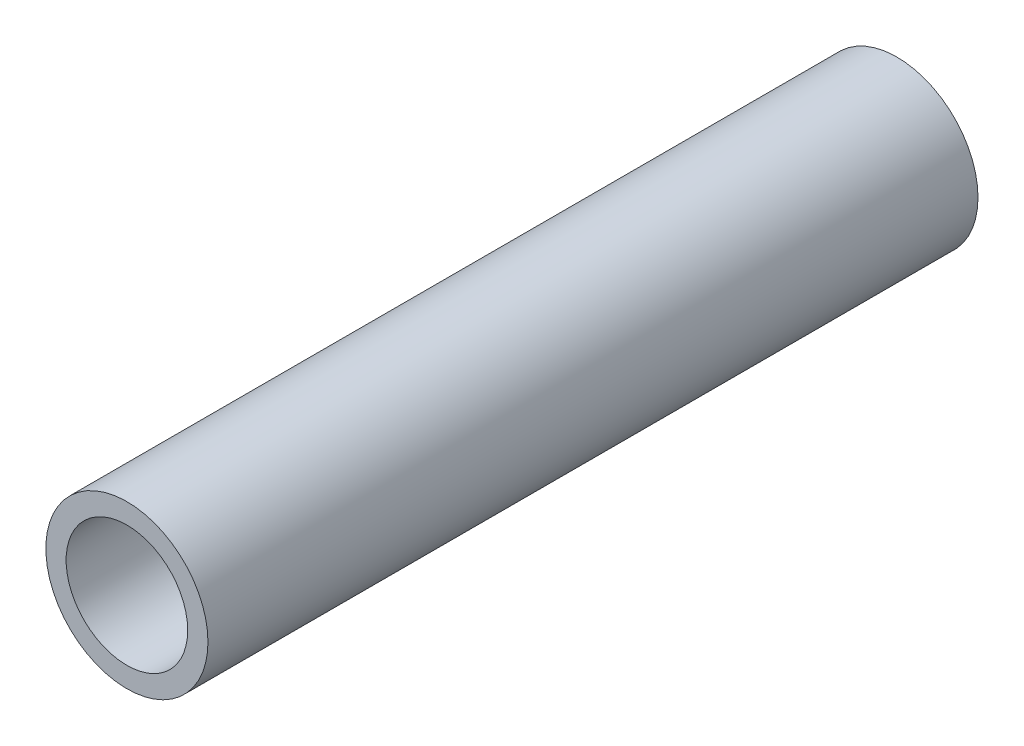
ISO-10303-21;
HEADER;
FILE_DESCRIPTION(('STEP AP214'),'2;1');
FILE_NAME('part.step','',(''),(''),'','','');
FILE_SCHEMA(('AUTOMOTIVE_DESIGN { 1 0 10303 214 1 1 1 1 }'));
ENDSEC;
DATA;
#1=APPLICATION_CONTEXT('core data for automotive mechanical design processes');
#2=APPLICATION_PROTOCOL_DEFINITION('international standard','automotive_design',2000,#1);
#3=PRODUCT_CONTEXT('',#1,'mechanical');
#4=PRODUCT('Part','Part','',(#3));
#5=PRODUCT_RELATED_PRODUCT_CATEGORY('part','',(#4));
#6=PRODUCT_DEFINITION_FORMATION('','',#4);
#7=PRODUCT_DEFINITION_CONTEXT('part definition',#1,'design');
#8=PRODUCT_DEFINITION('design','',#6,#7);
#9=PRODUCT_DEFINITION_SHAPE('','',#8);
#10=(LENGTH_UNIT() NAMED_UNIT(*) SI_UNIT(.MILLI.,.METRE.));
#11=(NAMED_UNIT(*) PLANE_ANGLE_UNIT() SI_UNIT($,.RADIAN.));
#12=(NAMED_UNIT(*) SI_UNIT($,.STERADIAN.) SOLID_ANGLE_UNIT());
#13=UNCERTAINTY_MEASURE_WITH_UNIT(LENGTH_MEASURE(1.E-05),#10,'distance_accuracy_value','');
#14=(GEOMETRIC_REPRESENTATION_CONTEXT(3) GLOBAL_UNCERTAINTY_ASSIGNED_CONTEXT((#13)) GLOBAL_UNIT_ASSIGNED_CONTEXT((#10,
#11,#12)) REPRESENTATION_CONTEXT('',''));
#15=CARTESIAN_POINT('',(0.,0.,0.));
#16=DIRECTION('',(0.,0.,1.));
#17=DIRECTION('',(1.,0.,0.));
#18=AXIS2_PLACEMENT_3D('',#15,#16,#17);
#19=CARTESIAN_POINT('',(0.,0.,38.));
#20=DIRECTION('',(0.,0.,1.));
#21=DIRECTION('',(1.,0.,0.));
#22=AXIS2_PLACEMENT_3D('',#19,#20,#21);
#23=PLANE('',#22);
#24=CARTESIAN_POINT('',(0.,0.,38.));
#25=DIRECTION('',(0.,0.,1.));
#26=DIRECTION('',(1.,0.,0.));
#27=AXIS2_PLACEMENT_3D('',#24,#25,#26);
#28=CIRCLE('',#27,4.);
#29=CARTESIAN_POINT('',(4.,0.,38.));
#30=VERTEX_POINT('',#29);
#31=EDGE_CURVE('E10',#30,#30,#28,.T.);
#32=ORIENTED_EDGE('',*,*,#31,.T.);
#33=EDGE_LOOP('',(#32));
#34=FACE_BOUND('',#33,.T.);
#35=CARTESIAN_POINT('',(0.,0.,38.));
#36=DIRECTION('',(0.,0.,1.));
#37=DIRECTION('',(1.,0.,0.));
#38=AXIS2_PLACEMENT_3D('',#35,#36,#37);
#39=CIRCLE('',#38,3.);
#40=CARTESIAN_POINT('',(3.,0.,38.));
#41=VERTEX_POINT('',#40);
#42=EDGE_CURVE('E41',#41,#41,#39,.T.);
#43=ORIENTED_EDGE('',*,*,#42,.F.);
#44=EDGE_LOOP('',(#43));
#45=FACE_BOUND('',#44,.T.);
#46=ADVANCED_FACE('F30',(#34,#45),#23,.T.);
#47=CARTESIAN_POINT('',(0.,0.,0.));
#48=DIRECTION('',(0.,0.,1.));
#49=DIRECTION('',(1.,0.,0.));
#50=AXIS2_PLACEMENT_3D('',#47,#48,#49);
#51=PLANE('',#50);
#52=CARTESIAN_POINT('',(0.,0.,0.));
#53=DIRECTION('',(0.,0.,1.));
#54=DIRECTION('',(1.,0.,0.));
#55=AXIS2_PLACEMENT_3D('',#52,#53,#54);
#56=CIRCLE('',#55,4.);
#57=CARTESIAN_POINT('',(4.,0.,0.));
#58=VERTEX_POINT('',#57);
#59=EDGE_CURVE('E34',#58,#58,#56,.T.);
#60=ORIENTED_EDGE('',*,*,#59,.F.);
#61=EDGE_LOOP('',(#60));
#62=FACE_BOUND('',#61,.T.);
#63=CARTESIAN_POINT('',(0.,0.,0.));
#64=DIRECTION('',(0.,0.,1.));
#65=DIRECTION('',(1.,0.,0.));
#66=AXIS2_PLACEMENT_3D('',#63,#64,#65);
#67=CIRCLE('',#66,3.);
#68=CARTESIAN_POINT('',(3.,0.,0.));
#69=VERTEX_POINT('',#68);
#70=EDGE_CURVE('E43',#69,#69,#67,.T.);
#71=ORIENTED_EDGE('',*,*,#70,.T.);
#72=EDGE_LOOP('',(#71));
#73=FACE_BOUND('',#72,.T.);
#74=ADVANCED_FACE('F53',(#62,#73),#51,.F.);
#75=CARTESIAN_POINT('',(0.,0.,38.));
#76=DIRECTION('',(0.,0.,-1.));
#77=DIRECTION('',(-1.,0.,0.));
#78=AXIS2_PLACEMENT_3D('',#75,#76,#77);
#79=CYLINDRICAL_SURFACE('',#78,4.);
#80=ORIENTED_EDGE('',*,*,#31,.F.);
#81=EDGE_LOOP('',(#80));
#82=FACE_BOUND('',#81,.T.);
#83=ORIENTED_EDGE('',*,*,#59,.T.);
#84=EDGE_LOOP('',(#83));
#85=FACE_BOUND('',#84,.T.);
#86=ADVANCED_FACE('F32',(#82,#85),#79,.T.);
#87=CARTESIAN_POINT('',(0.,0.,38.));
#88=DIRECTION('',(0.,0.,-1.));
#89=DIRECTION('',(-1.,0.,0.));
#90=AXIS2_PLACEMENT_3D('',#87,#88,#89);
#91=CYLINDRICAL_SURFACE('',#90,3.);
#92=ORIENTED_EDGE('',*,*,#42,.T.);
#93=EDGE_LOOP('',(#92));
#94=FACE_BOUND('',#93,.T.);
#95=ORIENTED_EDGE('',*,*,#70,.F.);
#96=EDGE_LOOP('',(#95));
#97=FACE_BOUND('',#96,.T.);
#98=ADVANCED_FACE('F49',(#94,#97),#91,.F.);
#99=CLOSED_SHELL('',(#46,#74,#86,#98));
#100=MANIFOLD_SOLID_BREP('B2',#99);
#101=ADVANCED_BREP_SHAPE_REPRESENTATION('',(#18,#100),#14);
#102=SHAPE_DEFINITION_REPRESENTATION(#9,#101);
ENDSEC;
END-ISO-10303-21;
